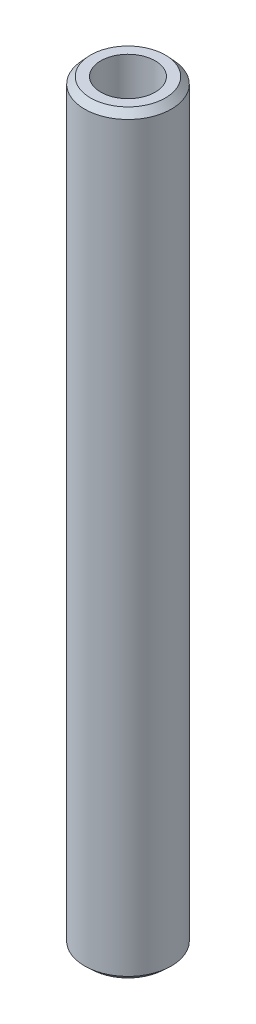
ISO-10303-21;
HEADER;
FILE_DESCRIPTION(('STEP AP214'),'2;1');
FILE_NAME('part.step','',(''),(''),'','','');
FILE_SCHEMA(('AUTOMOTIVE_DESIGN { 1 0 10303 214 1 1 1 1 }'));
ENDSEC;
DATA;
#1=APPLICATION_CONTEXT('core data for automotive mechanical design processes');
#2=APPLICATION_PROTOCOL_DEFINITION('international standard','automotive_design',2000,#1);
#3=PRODUCT_CONTEXT('',#1,'mechanical');
#4=PRODUCT('Part','Part','',(#3));
#5=PRODUCT_RELATED_PRODUCT_CATEGORY('part','',(#4));
#6=PRODUCT_DEFINITION_FORMATION('','',#4);
#7=PRODUCT_DEFINITION_CONTEXT('part definition',#1,'design');
#8=PRODUCT_DEFINITION('design','',#6,#7);
#9=PRODUCT_DEFINITION_SHAPE('','',#8);
#10=(LENGTH_UNIT() NAMED_UNIT(*) SI_UNIT(.MILLI.,.METRE.));
#11=(NAMED_UNIT(*) PLANE_ANGLE_UNIT() SI_UNIT($,.RADIAN.));
#12=(NAMED_UNIT(*) SI_UNIT($,.STERADIAN.) SOLID_ANGLE_UNIT());
#13=UNCERTAINTY_MEASURE_WITH_UNIT(LENGTH_MEASURE(1.E-05),#10,'distance_accuracy_value','');
#14=(GEOMETRIC_REPRESENTATION_CONTEXT(3) GLOBAL_UNCERTAINTY_ASSIGNED_CONTEXT((#13)) GLOBAL_UNIT_ASSIGNED_CONTEXT((#10,
#11,#12)) REPRESENTATION_CONTEXT('',''));
#15=CARTESIAN_POINT('',(0.,0.,0.));
#16=DIRECTION('',(0.,0.,1.));
#17=DIRECTION('',(1.,0.,0.));
#18=AXIS2_PLACEMENT_3D('',#15,#16,#17);
#19=CARTESIAN_POINT('',(0.,130.495948498376,0.));
#20=DIRECTION('',(0.,-1.,0.));
#21=DIRECTION('',(0.,0.,-1.));
#22=AXIS2_PLACEMENT_3D('',#19,#20,#21);
#23=CYLINDRICAL_SURFACE('',#22,7.5);
#24=CARTESIAN_POINT('',(0.,129.353850725739,0.));
#25=DIRECTION('',(0.,1.,0.));
#26=DIRECTION('',(0.,0.,1.));
#27=AXIS2_PLACEMENT_3D('',#24,#25,#26);
#28=CIRCLE('',#27,7.5);
#29=CARTESIAN_POINT('',(0.,129.353850725739,7.5));
#30=VERTEX_POINT('',#29);
#31=EDGE_CURVE('E50',#30,#30,#28,.F.);
#32=ORIENTED_EDGE('',*,*,#31,.T.);
#33=EDGE_LOOP('',(#32));
#34=FACE_BOUND('',#33,.T.);
#35=CARTESIAN_POINT('',(0.,1.04746536188099,0.));
#36=DIRECTION('',(0.,1.,0.));
#37=DIRECTION('',(0.,0.,1.));
#38=AXIS2_PLACEMENT_3D('',#35,#36,#37);
#39=CIRCLE('',#38,7.5);
#40=CARTESIAN_POINT('',(0.,1.04746536188099,7.5));
#41=VERTEX_POINT('',#40);
#42=EDGE_CURVE('E51',#41,#41,#39,.T.);
#43=ORIENTED_EDGE('',*,*,#42,.T.);
#44=EDGE_LOOP('',(#43));
#45=FACE_BOUND('',#44,.T.);
#46=ADVANCED_FACE('F39',(#34,#45),#23,.T.);
#47=CARTESIAN_POINT('',(0.,130.495948498376,0.));
#48=DIRECTION('',(0.,1.,0.));
#49=DIRECTION('',(0.,0.,1.));
#50=AXIS2_PLACEMENT_3D('',#47,#48,#49);
#51=PLANE('',#50);
#52=CARTESIAN_POINT('',(0.,130.495948498376,0.));
#53=DIRECTION('',(0.,1.,0.));
#54=DIRECTION('',(0.,0.,1.));
#55=AXIS2_PLACEMENT_3D('',#52,#53,#54);
#56=CIRCLE('',#55,6.45253463811898);
#57=CARTESIAN_POINT('',(0.,130.495948498376,6.45253463811898));
#58=VERTEX_POINT('',#57);
#59=EDGE_CURVE('E54',#58,#58,#56,.T.);
#60=ORIENTED_EDGE('',*,*,#59,.T.);
#61=EDGE_LOOP('',(#60));
#62=FACE_BOUND('',#61,.T.);
#63=CARTESIAN_POINT('',(0.,130.495948498376,0.));
#64=DIRECTION('',(0.,1.,0.));
#65=DIRECTION('',(0.,0.,1.));
#66=AXIS2_PLACEMENT_3D('',#63,#64,#65);
#67=CIRCLE('',#66,4.70786755077313);
#68=CARTESIAN_POINT('',(0.,130.495948498376,4.70786755077313));
#69=VERTEX_POINT('',#68);
#70=EDGE_CURVE('E58',#69,#69,#67,.T.);
#71=ORIENTED_EDGE('',*,*,#70,.F.);
#72=EDGE_LOOP('',(#71));
#73=FACE_BOUND('',#72,.T.);
#74=ADVANCED_FACE('F69',(#62,#73),#51,.T.);
#75=CARTESIAN_POINT('',(0.,0.,0.));
#76=DIRECTION('',(0.,1.,0.));
#77=DIRECTION('',(0.,0.,1.));
#78=AXIS2_PLACEMENT_3D('',#75,#76,#77);
#79=PLANE('',#78);
#80=CARTESIAN_POINT('',(0.,0.,0.));
#81=DIRECTION('',(0.,1.,0.));
#82=DIRECTION('',(0.,0.,1.));
#83=AXIS2_PLACEMENT_3D('',#80,#81,#82);
#84=CIRCLE('',#83,6.35790222736339);
#85=CARTESIAN_POINT('',(0.,0.,6.35790222736339));
#86=VERTEX_POINT('',#85);
#87=EDGE_CURVE('E10',#86,#86,#84,.F.);
#88=ORIENTED_EDGE('',*,*,#87,.T.);
#89=EDGE_LOOP('',(#88));
#90=FACE_BOUND('',#89,.T.);
#91=CARTESIAN_POINT('',(0.,0.,0.));
#92=DIRECTION('',(0.,1.,0.));
#93=DIRECTION('',(0.,0.,1.));
#94=AXIS2_PLACEMENT_3D('',#91,#92,#93);
#95=CIRCLE('',#94,4.70786755077313);
#96=CARTESIAN_POINT('',(0.,0.,4.70786755077313));
#97=VERTEX_POINT('',#96);
#98=EDGE_CURVE('E63',#97,#97,#95,.T.);
#99=ORIENTED_EDGE('',*,*,#98,.T.);
#100=EDGE_LOOP('',(#99));
#101=FACE_BOUND('',#100,.T.);
#102=ADVANCED_FACE('F75',(#90,#101),#79,.F.);
#103=CARTESIAN_POINT('',(0.,130.495948498376,0.));
#104=DIRECTION('',(0.,-1.,0.));
#105=DIRECTION('',(0.,0.,-1.));
#106=AXIS2_PLACEMENT_3D('',#103,#104,#105);
#107=CYLINDRICAL_SURFACE('',#106,4.70786755077313);
#108=ORIENTED_EDGE('',*,*,#70,.T.);
#109=EDGE_LOOP('',(#108));
#110=FACE_BOUND('',#109,.T.);
#111=ORIENTED_EDGE('',*,*,#98,.F.);
#112=EDGE_LOOP('',(#111));
#113=FACE_BOUND('',#112,.T.);
#114=ADVANCED_FACE('F70',(#110,#113),#107,.F.);
#115=CARTESIAN_POINT('',(0.,130.495948498376,0.));
#116=DIRECTION('',(0.,-1.,0.));
#117=DIRECTION('',(0.,0.,-1.));
#118=AXIS2_PLACEMENT_3D('',#115,#116,#117);
#119=CONICAL_SURFACE('',#118,6.45253463811898,0.742205276014047);
#120=ORIENTED_EDGE('',*,*,#31,.F.);
#121=EDGE_LOOP('',(#120));
#122=FACE_BOUND('',#121,.T.);
#123=ORIENTED_EDGE('',*,*,#59,.F.);
#124=EDGE_LOOP('',(#123));
#125=FACE_BOUND('',#124,.T.);
#126=ADVANCED_FACE('F81',(#122,#125),#119,.T.);
#127=CARTESIAN_POINT('',(0.,1.04746536188099,0.));
#128=DIRECTION('',(0.,1.,0.));
#129=DIRECTION('',(0.,0.,1.));
#130=AXIS2_PLACEMENT_3D('',#127,#128,#129);
#131=CONICAL_SURFACE('',#130,7.5,0.828591050780839);
#132=ORIENTED_EDGE('',*,*,#87,.F.);
#133=EDGE_LOOP('',(#132));
#134=FACE_BOUND('',#133,.T.);
#135=ORIENTED_EDGE('',*,*,#42,.F.);
#136=EDGE_LOOP('',(#135));
#137=FACE_BOUND('',#136,.T.);
#138=ADVANCED_FACE('F45',(#134,#137),#131,.T.);
#139=CLOSED_SHELL('',(#46,#74,#102,#114,#126,#138));
#140=MANIFOLD_SOLID_BREP('B2',#139);
#141=ADVANCED_BREP_SHAPE_REPRESENTATION('',(#18,#140),#14);
#142=SHAPE_DEFINITION_REPRESENTATION(#9,#141);
ENDSEC;
END-ISO-10303-21;
